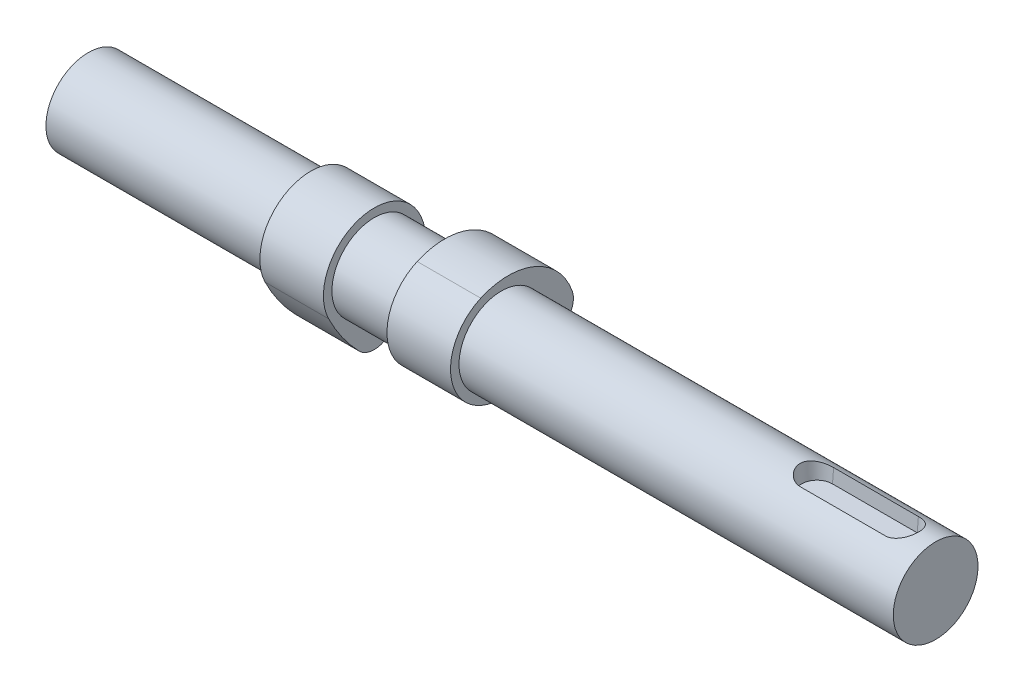
ISO-10303-21;
HEADER;
FILE_DESCRIPTION(('STEP AP214'),'2;1');
FILE_NAME('part.step','',(''),(''),'','','');
FILE_SCHEMA(('AUTOMOTIVE_DESIGN { 1 0 10303 214 1 1 1 1 }'));
ENDSEC;
DATA;
#1=APPLICATION_CONTEXT('core data for automotive mechanical design processes');
#2=APPLICATION_PROTOCOL_DEFINITION('international standard','automotive_design',2000,#1);
#3=PRODUCT_CONTEXT('',#1,'mechanical');
#4=PRODUCT('Part','Part','',(#3));
#5=PRODUCT_RELATED_PRODUCT_CATEGORY('part','',(#4));
#6=PRODUCT_DEFINITION_FORMATION('','',#4);
#7=PRODUCT_DEFINITION_CONTEXT('part definition',#1,'design');
#8=PRODUCT_DEFINITION('design','',#6,#7);
#9=PRODUCT_DEFINITION_SHAPE('','',#8);
#10=(LENGTH_UNIT() NAMED_UNIT(*) SI_UNIT(.MILLI.,.METRE.));
#11=(NAMED_UNIT(*) PLANE_ANGLE_UNIT() SI_UNIT($,.RADIAN.));
#12=(NAMED_UNIT(*) SI_UNIT($,.STERADIAN.) SOLID_ANGLE_UNIT());
#13=UNCERTAINTY_MEASURE_WITH_UNIT(LENGTH_MEASURE(1.E-05),#10,'distance_accuracy_value','');
#14=(GEOMETRIC_REPRESENTATION_CONTEXT(3) GLOBAL_UNCERTAINTY_ASSIGNED_CONTEXT((#13)) GLOBAL_UNIT_ASSIGNED_CONTEXT((#10,
#11,#12)) REPRESENTATION_CONTEXT('',''));
#15=CARTESIAN_POINT('',(0.,0.,0.));
#16=DIRECTION('',(0.,0.,1.));
#17=DIRECTION('',(1.,0.,0.));
#18=AXIS2_PLACEMENT_3D('',#15,#16,#17);
#19=CARTESIAN_POINT('',(-22.5,-1.62236318948022,3.65621904177247));
#20=DIRECTION('',(1.,0.,0.));
#21=DIRECTION('',(0.,1.,0.));
#22=AXIS2_PLACEMENT_3D('',#19,#20,#21);
#23=CYLINDRICAL_SURFACE('',#22,16.);
#24=CARTESIAN_POINT('',(-7.5,-1.62236318948022,3.65621904177247));
#25=DIRECTION('',(1.,0.,0.));
#26=DIRECTION('',(0.,1.,0.));
#27=AXIS2_PLACEMENT_3D('',#24,#25,#26);
#28=CIRCLE('',#27,16.);
#29=CARTESIAN_POINT('',(-7.5,-16.7126720366766,-1.66191774626015));
#30=VERTEX_POINT('',#29);
#31=CARTESIAN_POINT('',(-7.5,4.86708956844066,-10.9686571253174));
#32=VERTEX_POINT('',#31);
#33=EDGE_CURVE('E111',#30,#32,#28,.T.);
#34=ORIENTED_EDGE('',*,*,#33,.F.);
#35=DIRECTION('',(1.,0.,0.));
#36=VECTOR('',#35,1.);
#37=CARTESIAN_POINT('',(-22.5,-16.7126720366766,-1.66191774626015));
#38=LINE('',#37,#36);
#39=CARTESIAN_POINT('',(-22.5,-16.7126720366766,-1.66191774626015));
#40=VERTEX_POINT('',#39);
#41=EDGE_CURVE('E110',#40,#30,#38,.T.);
#42=ORIENTED_EDGE('',*,*,#41,.F.);
#43=CARTESIAN_POINT('',(-22.5,-1.62236318948022,3.65621904177247));
#44=DIRECTION('',(1.,0.,0.));
#45=DIRECTION('',(0.,1.,0.));
#46=AXIS2_PLACEMENT_3D('',#43,#44,#45);
#47=CIRCLE('',#46,16.);
#48=CARTESIAN_POINT('',(-22.5,4.86708956844066,-10.9686571253174));
#49=VERTEX_POINT('',#48);
#50=EDGE_CURVE('E105',#40,#49,#47,.T.);
#51=ORIENTED_EDGE('',*,*,#50,.T.);
#52=DIRECTION('',(1.,0.,0.));
#53=VECTOR('',#52,1.);
#54=CARTESIAN_POINT('',(-22.5,4.86708956844066,-10.9686571253174));
#55=LINE('',#54,#53);
#56=EDGE_CURVE('E12',#49,#32,#55,.T.);
#57=ORIENTED_EDGE('',*,*,#56,.T.);
#58=EDGE_LOOP('',(#34,#42,#51,#57));
#59=FACE_BOUND('',#58,.T.);
#60=ADVANCED_FACE('F48',(#59),#23,.T.);
#61=CARTESIAN_POINT('',(-22.5,0.,0.));
#62=DIRECTION('',(1.,0.,0.));
#63=DIRECTION('',(0.,1.,0.));
#64=AXIS2_PLACEMENT_3D('',#61,#62,#63);
#65=CYLINDRICAL_SURFACE('',#64,12.);
#66=CARTESIAN_POINT('',(-7.5,0.,0.));
#67=DIRECTION('',(1.,0.,0.));
#68=DIRECTION('',(0.,-1.,0.));
#69=AXIS2_PLACEMENT_3D('',#66,#67,#68);
#70=CIRCLE('',#69,12.);
#71=CARTESIAN_POINT('',(-7.5,-5.30622661682885,10.7630831591537));
#72=VERTEX_POINT('',#71);
#73=EDGE_CURVE('E113',#32,#72,#70,.T.);
#74=ORIENTED_EDGE('',*,*,#73,.F.);
#75=ORIENTED_EDGE('',*,*,#56,.F.);
#76=CARTESIAN_POINT('',(-22.5,0.,0.));
#77=DIRECTION('',(1.,0.,0.));
#78=DIRECTION('',(0.,-1.,0.));
#79=AXIS2_PLACEMENT_3D('',#76,#77,#78);
#80=CIRCLE('',#79,12.);
#81=CARTESIAN_POINT('',(-22.5,-5.30622661682885,10.7630831591537));
#82=VERTEX_POINT('',#81);
#83=EDGE_CURVE('E89',#49,#82,#80,.T.);
#84=ORIENTED_EDGE('',*,*,#83,.T.);
#85=DIRECTION('',(1.,0.,0.));
#86=VECTOR('',#85,1.);
#87=CARTESIAN_POINT('',(-22.5,-5.30622661682885,10.7630831591537));
#88=LINE('',#87,#86);
#89=EDGE_CURVE('E56',#82,#72,#88,.T.);
#90=ORIENTED_EDGE('',*,*,#89,.T.);
#91=EDGE_LOOP('',(#74,#75,#84,#90));
#92=FACE_BOUND('',#91,.T.);
#93=ADVANCED_FACE('F103',(#92),#65,.T.);
#94=CARTESIAN_POINT('',(-22.5,12.3811954392673,-25.1138607046919));
#95=DIRECTION('',(1.,0.,0.));
#96=DIRECTION('',(0.,1.,0.));
#97=AXIS2_PLACEMENT_3D('',#94,#95,#96);
#98=CYLINDRICAL_SURFACE('',#97,40.);
#99=CARTESIAN_POINT('',(-7.5,12.3811954392673,-25.1138607046919));
#100=DIRECTION('',(1.,0.,0.));
#101=DIRECTION('',(0.,-1.,0.));
#102=AXIS2_PLACEMENT_3D('',#99,#100,#101);
#103=CIRCLE('',#102,40.);
#104=CARTESIAN_POINT('',(-7.5,-15.4795428020985,3.58769438638459));
#105=VERTEX_POINT('',#104);
#106=EDGE_CURVE('E99',#72,#105,#103,.T.);
#107=ORIENTED_EDGE('',*,*,#106,.F.);
#108=ORIENTED_EDGE('',*,*,#89,.F.);
#109=CARTESIAN_POINT('',(-22.5,12.3811954392673,-25.1138607046919));
#110=DIRECTION('',(1.,0.,0.));
#111=DIRECTION('',(0.,-1.,0.));
#112=AXIS2_PLACEMENT_3D('',#109,#110,#111);
#113=CIRCLE('',#112,40.);
#114=CARTESIAN_POINT('',(-22.5,-15.4795428020985,3.58769438638459));
#115=VERTEX_POINT('',#114);
#116=EDGE_CURVE('E92',#82,#115,#113,.T.);
#117=ORIENTED_EDGE('',*,*,#116,.T.);
#118=DIRECTION('',(1.,0.,0.));
#119=VECTOR('',#118,1.);
#120=CARTESIAN_POINT('',(-22.5,-15.4795428020985,3.58769438638459));
#121=LINE('',#120,#119);
#122=EDGE_CURVE('E102',#115,#105,#121,.T.);
#123=ORIENTED_EDGE('',*,*,#122,.T.);
#124=EDGE_LOOP('',(#107,#108,#117,#123));
#125=FACE_BOUND('',#124,.T.);
#126=ADVANCED_FACE('F98',(#125),#98,.T.);
#127=CARTESIAN_POINT('',(-22.5,-11.9969505219277,0.));
#128=DIRECTION('',(1.,0.,0.));
#129=DIRECTION('',(0.,1.,0.));
#130=AXIS2_PLACEMENT_3D('',#127,#128,#129);
#131=CYLINDRICAL_SURFACE('',#130,5.);
#132=CARTESIAN_POINT('',(-7.5,-11.9969505219277,0.));
#133=DIRECTION('',(1.,0.,0.));
#134=DIRECTION('',(0.,1.,0.));
#135=AXIS2_PLACEMENT_3D('',#132,#133,#134);
#136=CIRCLE('',#135,5.);
#137=EDGE_CURVE('E78',#105,#30,#136,.T.);
#138=ORIENTED_EDGE('',*,*,#137,.F.);
#139=ORIENTED_EDGE('',*,*,#122,.F.);
#140=CARTESIAN_POINT('',(-22.5,-11.9969505219277,0.));
#141=DIRECTION('',(1.,0.,0.));
#142=DIRECTION('',(0.,1.,0.));
#143=AXIS2_PLACEMENT_3D('',#140,#141,#142);
#144=CIRCLE('',#143,5.);
#145=EDGE_CURVE('E64',#115,#40,#144,.T.);
#146=ORIENTED_EDGE('',*,*,#145,.T.);
#147=ORIENTED_EDGE('',*,*,#41,.T.);
#148=EDGE_LOOP('',(#138,#139,#146,#147));
#149=FACE_BOUND('',#148,.T.);
#150=ADVANCED_FACE('F122',(#149),#131,.T.);
#151=CARTESIAN_POINT('',(-22.5,-6.80965685570399,1.82810952088625));
#152=DIRECTION('',(1.,0.,0.));
#153=DIRECTION('',(0.,1.,0.));
#154=AXIS2_PLACEMENT_3D('',#151,#152,#153);
#155=PLANE('',#154);
#156=ORIENTED_EDGE('',*,*,#50,.F.);
#157=ORIENTED_EDGE('',*,*,#145,.F.);
#158=ORIENTED_EDGE('',*,*,#116,.F.);
#159=ORIENTED_EDGE('',*,*,#83,.F.);
#160=EDGE_LOOP('',(#156,#157,#158,#159));
#161=FACE_BOUND('',#160,.T.);
#162=ADVANCED_FACE('F94',(#161),#155,.F.);
#163=CARTESIAN_POINT('',(-7.5,-6.80965685570399,1.82810952088625));
#164=DIRECTION('',(1.,0.,0.));
#165=DIRECTION('',(0.,1.,0.));
#166=AXIS2_PLACEMENT_3D('',#163,#164,#165);
#167=PLANE('',#166);
#168=ORIENTED_EDGE('',*,*,#33,.T.);
#169=ORIENTED_EDGE('',*,*,#73,.T.);
#170=ORIENTED_EDGE('',*,*,#106,.T.);
#171=ORIENTED_EDGE('',*,*,#137,.T.);
#172=EDGE_LOOP('',(#168,#169,#170,#171));
#173=FACE_BOUND('',#172,.T.);
#174=ADVANCED_FACE('F118',(#173),#167,.T.);
#175=CLOSED_SHELL('',(#60,#93,#126,#150,#162,#174));
#176=MANIFOLD_SOLID_BREP('B2',#175);
#177=CARTESIAN_POINT('',(22.5,-3.65621904177246,-1.62236318948023));
#178=DIRECTION('',(-1.,0.,0.));
#179=DIRECTION('',(0.,0.,1.));
#180=AXIS2_PLACEMENT_3D('',#177,#178,#179);
#181=CYLINDRICAL_SURFACE('',#180,16.);
#182=CARTESIAN_POINT('',(7.5,-3.65621904177246,-1.62236318948023));
#183=DIRECTION('',(1.,0.,0.));
#184=DIRECTION('',(0.,0.,1.));
#185=AXIS2_PLACEMENT_3D('',#182,#183,#184);
#186=CIRCLE('',#185,16.);
#187=CARTESIAN_POINT('',(7.5,1.66191774626021,-16.7126720366766));
#188=VERTEX_POINT('',#187);
#189=CARTESIAN_POINT('',(7.5,10.9686571253174,4.8670895684407));
#190=VERTEX_POINT('',#189);
#191=EDGE_CURVE('E246',#188,#190,#186,.T.);
#192=ORIENTED_EDGE('',*,*,#191,.T.);
#193=DIRECTION('',(-1.,0.,0.));
#194=VECTOR('',#193,1.);
#195=CARTESIAN_POINT('',(22.5,10.9686571253174,4.8670895684407));
#196=LINE('',#195,#194);
#197=CARTESIAN_POINT('',(22.5,10.9686571253174,4.8670895684407));
#198=VERTEX_POINT('',#197);
#199=EDGE_CURVE('E46',#198,#190,#196,.T.);
#200=ORIENTED_EDGE('',*,*,#199,.F.);
#201=CARTESIAN_POINT('',(22.5,-3.65621904177246,-1.62236318948023));
#202=DIRECTION('',(1.,0.,0.));
#203=DIRECTION('',(0.,0.,1.));
#204=AXIS2_PLACEMENT_3D('',#201,#202,#203);
#205=CIRCLE('',#204,16.);
#206=CARTESIAN_POINT('',(22.5,1.66191774626021,-16.7126720366766));
#207=VERTEX_POINT('',#206);
#208=EDGE_CURVE('E234',#207,#198,#205,.T.);
#209=ORIENTED_EDGE('',*,*,#208,.F.);
#210=DIRECTION('',(-1.,0.,0.));
#211=VECTOR('',#210,1.);
#212=CARTESIAN_POINT('',(22.5,1.66191774626021,-16.7126720366766));
#213=LINE('',#212,#211);
#214=EDGE_CURVE('E242',#207,#188,#213,.T.);
#215=ORIENTED_EDGE('',*,*,#214,.T.);
#216=EDGE_LOOP('',(#192,#200,#209,#215));
#217=FACE_BOUND('',#216,.T.);
#218=ADVANCED_FACE('F183',(#217),#181,.T.);
#219=CARTESIAN_POINT('',(22.5,0.,0.));
#220=DIRECTION('',(-1.,0.,0.));
#221=DIRECTION('',(0.,0.,1.));
#222=AXIS2_PLACEMENT_3D('',#219,#220,#221);
#223=CYLINDRICAL_SURFACE('',#222,12.);
#224=CARTESIAN_POINT('',(7.5,0.,0.));
#225=DIRECTION('',(1.,0.,0.));
#226=DIRECTION('',(0.,0.,-1.));
#227=AXIS2_PLACEMENT_3D('',#224,#225,#226);
#228=CIRCLE('',#227,12.);
#229=CARTESIAN_POINT('',(7.5,-10.7630831591536,-5.30622661682888));
#230=VERTEX_POINT('',#229);
#231=EDGE_CURVE('E238',#190,#230,#228,.T.);
#232=ORIENTED_EDGE('',*,*,#231,.T.);
#233=DIRECTION('',(-1.,0.,0.));
#234=VECTOR('',#233,1.);
#235=CARTESIAN_POINT('',(22.5,-10.7630831591536,-5.30622661682888));
#236=LINE('',#235,#234);
#237=CARTESIAN_POINT('',(22.5,-10.7630831591536,-5.30622661682888));
#238=VERTEX_POINT('',#237);
#239=EDGE_CURVE('E191',#238,#230,#236,.T.);
#240=ORIENTED_EDGE('',*,*,#239,.F.);
#241=CARTESIAN_POINT('',(22.5,0.,0.));
#242=DIRECTION('',(1.,0.,0.));
#243=DIRECTION('',(0.,0.,-1.));
#244=AXIS2_PLACEMENT_3D('',#241,#242,#243);
#245=CIRCLE('',#244,12.);
#246=EDGE_CURVE('E229',#198,#238,#245,.T.);
#247=ORIENTED_EDGE('',*,*,#246,.F.);
#248=ORIENTED_EDGE('',*,*,#199,.T.);
#249=EDGE_LOOP('',(#232,#240,#247,#248));
#250=FACE_BOUND('',#249,.T.);
#251=ADVANCED_FACE('F237',(#250),#223,.T.);
#252=CARTESIAN_POINT('',(22.5,25.1138607046918,12.3811954392674));
#253=DIRECTION('',(-1.,0.,0.));
#254=DIRECTION('',(0.,0.,1.));
#255=AXIS2_PLACEMENT_3D('',#252,#253,#254);
#256=CYLINDRICAL_SURFACE('',#255,40.);
#257=CARTESIAN_POINT('',(7.5,25.1138607046918,12.3811954392674));
#258=DIRECTION('',(1.,0.,0.));
#259=DIRECTION('',(0.,0.,-1.));
#260=AXIS2_PLACEMENT_3D('',#257,#258,#259);
#261=CIRCLE('',#260,40.);
#262=CARTESIAN_POINT('',(7.5,-3.58769438638454,-15.4795428020985));
#263=VERTEX_POINT('',#262);
#264=EDGE_CURVE('E216',#230,#263,#261,.T.);
#265=ORIENTED_EDGE('',*,*,#264,.T.);
#266=DIRECTION('',(-1.,0.,0.));
#267=VECTOR('',#266,1.);
#268=CARTESIAN_POINT('',(22.5,-3.58769438638454,-15.4795428020985));
#269=LINE('',#268,#267);
#270=CARTESIAN_POINT('',(22.5,-3.58769438638454,-15.4795428020985));
#271=VERTEX_POINT('',#270);
#272=EDGE_CURVE('E239',#271,#263,#269,.T.);
#273=ORIENTED_EDGE('',*,*,#272,.F.);
#274=CARTESIAN_POINT('',(22.5,25.1138607046918,12.3811954392674));
#275=DIRECTION('',(1.,0.,0.));
#276=DIRECTION('',(0.,0.,-1.));
#277=AXIS2_PLACEMENT_3D('',#274,#275,#276);
#278=CIRCLE('',#277,40.);
#279=EDGE_CURVE('E232',#238,#271,#278,.T.);
#280=ORIENTED_EDGE('',*,*,#279,.F.);
#281=ORIENTED_EDGE('',*,*,#239,.T.);
#282=EDGE_LOOP('',(#265,#273,#280,#281));
#283=FACE_BOUND('',#282,.T.);
#284=ADVANCED_FACE('F240',(#283),#256,.T.);
#285=CARTESIAN_POINT('',(22.5,0.,-11.9969505219277));
#286=DIRECTION('',(-1.,0.,0.));
#287=DIRECTION('',(0.,0.,1.));
#288=AXIS2_PLACEMENT_3D('',#285,#286,#287);
#289=CYLINDRICAL_SURFACE('',#288,5.);
#290=CARTESIAN_POINT('',(7.5,0.,-11.9969505219277));
#291=DIRECTION('',(1.,0.,0.));
#292=DIRECTION('',(0.,0.,1.));
#293=AXIS2_PLACEMENT_3D('',#290,#291,#292);
#294=CIRCLE('',#293,5.);
#295=EDGE_CURVE('E222',#263,#188,#294,.T.);
#296=ORIENTED_EDGE('',*,*,#295,.T.);
#297=ORIENTED_EDGE('',*,*,#214,.F.);
#298=CARTESIAN_POINT('',(22.5,0.,-11.9969505219277));
#299=DIRECTION('',(1.,0.,0.));
#300=DIRECTION('',(0.,0.,1.));
#301=AXIS2_PLACEMENT_3D('',#298,#299,#300);
#302=CIRCLE('',#301,5.);
#303=EDGE_CURVE('E199',#271,#207,#302,.T.);
#304=ORIENTED_EDGE('',*,*,#303,.F.);
#305=ORIENTED_EDGE('',*,*,#272,.T.);
#306=EDGE_LOOP('',(#296,#297,#304,#305));
#307=FACE_BOUND('',#306,.T.);
#308=ADVANCED_FACE('F253',(#307),#289,.T.);
#309=CARTESIAN_POINT('',(22.5,-1.82810952088623,-6.80965685570399));
#310=DIRECTION('',(-1.,0.,0.));
#311=DIRECTION('',(0.,0.,1.));
#312=AXIS2_PLACEMENT_3D('',#309,#310,#311);
#313=PLANE('',#312);
#314=ORIENTED_EDGE('',*,*,#208,.T.);
#315=ORIENTED_EDGE('',*,*,#246,.T.);
#316=ORIENTED_EDGE('',*,*,#279,.T.);
#317=ORIENTED_EDGE('',*,*,#303,.T.);
#318=EDGE_LOOP('',(#314,#315,#316,#317));
#319=FACE_BOUND('',#318,.T.);
#320=ADVANCED_FACE('F230',(#319),#313,.F.);
#321=CARTESIAN_POINT('',(7.5,-1.82810952088623,-6.80965685570399));
#322=DIRECTION('',(-1.,0.,0.));
#323=DIRECTION('',(0.,0.,1.));
#324=AXIS2_PLACEMENT_3D('',#321,#322,#323);
#325=PLANE('',#324);
#326=ORIENTED_EDGE('',*,*,#191,.F.);
#327=ORIENTED_EDGE('',*,*,#295,.F.);
#328=ORIENTED_EDGE('',*,*,#264,.F.);
#329=ORIENTED_EDGE('',*,*,#231,.F.);
#330=EDGE_LOOP('',(#326,#327,#328,#329));
#331=FACE_BOUND('',#330,.T.);
#332=ADVANCED_FACE('F256',(#331),#325,.T.);
#333=CLOSED_SHELL('',(#218,#251,#284,#308,#320,#332));
#334=MANIFOLD_SOLID_BREP('B6',#333);
#335=CARTESIAN_POINT('',(-75.,0.,0.));
#336=DIRECTION('',(1.,0.,0.));
#337=DIRECTION('',(0.,0.,-1.));
#338=AXIS2_PLACEMENT_3D('',#335,#336,#337);
#339=CYLINDRICAL_SURFACE('',#338,10.);
#340=CARTESIAN_POINT('',(116.9998,9.19554732162667,3.92961950520971));
#341=CARTESIAN_POINT('',(117.108432526229,9.195523964617,3.92963900895938));
#342=CARTESIAN_POINT('',(117.217054442407,9.19739790113637,3.92528821148888));
#343=CARTESIAN_POINT('',(117.433449189068,9.20478322107422,3.90795696349252));
#344=CARTESIAN_POINT('',(117.541222281507,9.21029343390919,3.89497929010511));
#345=CARTESIAN_POINT('',(117.754805249896,9.22477014169951,3.86056266999496));
#346=CARTESIAN_POINT('',(117.860620479704,9.23372503404509,3.83915212174359));
#347=CARTESIAN_POINT('',(118.069896437043,9.25479066145063,3.78808770588497));
#348=CARTESIAN_POINT('',(118.173357048389,9.26690155187349,3.75843343245227));
#349=CARTESIAN_POINT('',(118.478997114603,9.30741193624863,3.65751207972482));
#350=CARTESIAN_POINT('',(118.676801412905,9.34001597020544,3.57422665843843));
#351=CARTESIAN_POINT('',(119.055656727802,9.41272444967854,3.37809141880251));
#352=CARTESIAN_POINT('',(119.236694043575,9.45283494952219,3.26521770641159));
#353=CARTESIAN_POINT('',(119.586163210606,9.53832850590639,3.00660395270599));
#354=CARTESIAN_POINT('',(119.75359745749,9.58387103250205,2.85956460575029));
#355=CARTESIAN_POINT('',(120.06167183687,9.67365894564606,2.53928149200147));
#356=CARTESIAN_POINT('',(120.202307528385,9.7179041161741,2.36603339048636));
#357=CARTESIAN_POINT('',(120.455271105667,9.80118313396661,1.99346714637655));
#358=CARTESIAN_POINT('',(120.566978377658,9.84009542627471,1.79369791629397));
#359=CARTESIAN_POINT('',(120.754126120008,9.90710575454472,1.37616732968246));
#360=CARTESIAN_POINT('',(120.829586514252,9.93520972983524,1.15841593476275));
#361=CARTESIAN_POINT('',(120.937423647946,9.97586398416612,0.725552222129558));
#362=CARTESIAN_POINT('',(120.972183980034,9.98927144663287,0.511115107829932));
#363=CARTESIAN_POINT('',(121.005253036647,10.0020189726074,0.0790606490660696));
#364=CARTESIAN_POINT('',(121.003575139474,10.0013641990691,-0.138555498890744));
#365=CARTESIAN_POINT('',(120.965065772481,9.98653634618633,-0.55713437731378));
#366=CARTESIAN_POINT('',(120.930314495065,9.97316323800987,-0.758322063329801));
#367=CARTESIAN_POINT('',(120.830073130865,9.93541593559446,-1.15177617887117));
#368=CARTESIAN_POINT('',(120.764581003034,9.91104101089147,-1.34404201509667));
#369=CARTESIAN_POINT('',(120.603676754373,9.8530923067776,-1.71848117040827));
#370=CARTESIAN_POINT('',(120.50772071095,9.81935282430629,-1.90039390354836));
#371=CARTESIAN_POINT('',(120.289247885583,9.74606742103519,-2.24621081177601));
#372=CARTESIAN_POINT('',(120.166721786218,9.70651946492988,-2.41010863904958));
#373=CARTESIAN_POINT('',(119.888474496445,9.62225347352947,-2.72785507367911));
#374=CARTESIAN_POINT('',(119.730991599461,9.57736844831364,-2.88011561690002));
#375=CARTESIAN_POINT('',(119.39269852426,9.48965886456742,-3.15714116902367));
#376=CARTESIAN_POINT('',(119.211877236817,9.44683530072072,-3.28189300651247));
#377=CARTESIAN_POINT('',(118.922606169477,9.38686542506334,-3.44824964477365));
#378=CARTESIAN_POINT('',(118.820957447824,9.36724202522513,-3.50106618947219));
#379=CARTESIAN_POINT('',(118.613181248028,9.33044058072898,-3.5979946757925));
#380=CARTESIAN_POINT('',(118.507055578203,9.31326156077457,-3.64211009185354));
#381=CARTESIAN_POINT('',(118.291154422689,9.28193522243321,-3.72122180241614));
#382=CARTESIAN_POINT('',(118.181382861742,9.26778475870701,-3.75622756608453));
#383=CARTESIAN_POINT('',(117.958933082548,9.24298582877054,-3.81684131432378));
#384=CARTESIAN_POINT('',(117.846256085105,9.23233591674958,-3.84245317930481));
#385=CARTESIAN_POINT('',(117.611930809076,9.21440060696265,-3.88528372873352));
#386=CARTESIAN_POINT('',(117.490152858103,9.20735840438907,-3.90189924806992));
#387=CARTESIAN_POINT('',(117.245519514609,9.19791466072453,-3.92407823700824));
#388=CARTESIAN_POINT('',(117.122665085282,9.19550932696913,-3.92965073920191));
#389=CARTESIAN_POINT('',(116.9998,9.19554732162666,-3.92961950520972));
#390=B_SPLINE_CURVE_WITH_KNOTS('',3,(#340,#341,#342,#343,#344,#345,#346,#347,#348,#349,#350,
#351,#352,#353,#354,#355,#356,#357,#358,#359,#360,#361,#362,#363,#364,#365,#366,#367,#368,#369,
#370,#371,#372,#373,#374,#375,#376,#377,#378,#379,#380,#381,#382,#383,#384,#385,#386,#387,#388,
#389),.UNSPECIFIED.,.F.,.F.,(4,2,2,2,2,2,2,2,2,2,2,2,2,2,2,2,2,2,2,2,2,2,2,2,4),(0.,
0.325775853756532,0.651446885464914,0.976030440919044,1.3006299779342,1.94872565760357,
2.59734632832016,3.27656669617222,3.9558995248008,4.64878303442882,5.34128524851461,
5.99080148182277,6.64007924914105,7.25104428619564,7.86204989415494,8.48464423808043,
9.10745726360786,9.77538752835235,10.4436369129641,10.7919327546046,11.1400892357431,
11.4878823615824,11.8355316596004,12.2042630896941,12.5726927926964),.UNSPECIFIED.);
#391=CARTESIAN_POINT('',(117.,9.19554731953007,3.92961951011584));
#392=VERTEX_POINT('',#391);
#393=CARTESIAN_POINT('',(117.,9.19554731953009,-3.92961951011584));
#394=VERTEX_POINT('',#393);
#395=EDGE_CURVE('E384',#392,#394,#390,.T.);
#396=ORIENTED_EDGE('',*,*,#395,.F.);
#397=DIRECTION('',(1.,0.,0.));
#398=VECTOR('',#397,1.);
#399=CARTESIAN_POINT('',(-75.,9.19554731953007,3.92961951011589));
#400=LINE('',#399,#398);
#401=CARTESIAN_POINT('',(97.,9.19554731953009,3.92961951011584));
#402=VERTEX_POINT('',#401);
#403=EDGE_CURVE('E181',#402,#392,#400,.T.);
#404=ORIENTED_EDGE('',*,*,#403,.F.);
#405=CARTESIAN_POINT('',(97.0002,9.19554732162667,-3.92961950520971));
#406=CARTESIAN_POINT('',(96.8915674737709,9.19552396461699,-3.92963900895938));
#407=CARTESIAN_POINT('',(96.7829455575925,9.19739790113637,-3.92528821148888));
#408=CARTESIAN_POINT('',(96.5665508109321,9.20478322107422,-3.90795696349252));
#409=CARTESIAN_POINT('',(96.4587777184928,9.21029343390919,-3.89497929010511));
#410=CARTESIAN_POINT('',(96.2451947501037,9.22477014169951,-3.86056266999496));
#411=CARTESIAN_POINT('',(96.1393795202961,9.23372503404509,-3.83915212174359));
#412=CARTESIAN_POINT('',(95.9301035629571,9.25479066145063,-3.78808770588497));
#413=CARTESIAN_POINT('',(95.8266429516112,9.26690155187349,-3.75843343245227));
#414=CARTESIAN_POINT('',(95.5210028853967,9.30741193624863,-3.65751207972481));
#415=CARTESIAN_POINT('',(95.3231985870946,9.34001597020544,-3.57422665843843));
#416=CARTESIAN_POINT('',(94.9443432721979,9.41272444967854,-3.3780914188025));
#417=CARTESIAN_POINT('',(94.7633059564248,9.45283494952219,-3.26521770641159));
#418=CARTESIAN_POINT('',(94.413836789394,9.53832850590639,-3.00660395270599));
#419=CARTESIAN_POINT('',(94.2464025425101,9.58387103250205,-2.85956460575029));
#420=CARTESIAN_POINT('',(93.9383281631304,9.67365894564606,-2.53928149200146));
#421=CARTESIAN_POINT('',(93.7976924716152,9.7179041161741,-2.36603339048636));
#422=CARTESIAN_POINT('',(93.544728894333,9.80118313396661,-1.99346714637655));
#423=CARTESIAN_POINT('',(93.4330216223424,9.84009542627471,-1.79369791629397));
#424=CARTESIAN_POINT('',(93.2458738799919,9.90710575454472,-1.37616732968245));
#425=CARTESIAN_POINT('',(93.1704134857481,9.93520972983524,-1.15841593476274));
#426=CARTESIAN_POINT('',(93.0625763520545,9.97586398416612,-0.725552222129557));
#427=CARTESIAN_POINT('',(93.0278160199655,9.98927144663287,-0.511115107829932));
#428=CARTESIAN_POINT('',(92.9947469633532,10.0020189726074,-0.0790606490660688));
#429=CARTESIAN_POINT('',(92.9964248605263,10.0013641990691,0.138555498890745));
#430=CARTESIAN_POINT('',(93.0349342275193,9.98653634618633,0.557134377313781));
#431=CARTESIAN_POINT('',(93.0696855049347,9.97316323800987,0.758322063329801));
#432=CARTESIAN_POINT('',(93.1699268691349,9.93541593559446,1.15177617887117));
#433=CARTESIAN_POINT('',(93.2354189969656,9.91104101089147,1.34404201509667));
#434=CARTESIAN_POINT('',(93.3963232456273,9.8530923067776,1.71848117040827));
#435=CARTESIAN_POINT('',(93.4922792890503,9.81935282430629,1.90039390354836));
#436=CARTESIAN_POINT('',(93.7107521144166,9.74606742103519,2.24621081177601));
#437=CARTESIAN_POINT('',(93.8332782137822,9.70651946492988,2.41010863904958));
#438=CARTESIAN_POINT('',(94.1115255035547,9.62225347352947,2.7278550736791));
#439=CARTESIAN_POINT('',(94.2690084005388,9.57736844831365,2.88011561690001));
#440=CARTESIAN_POINT('',(94.6073014757403,9.48965886456742,3.15714116902367));
#441=CARTESIAN_POINT('',(94.7881227631832,9.44683530072072,3.28189300651247));
#442=CARTESIAN_POINT('',(95.0773938305227,9.38686542506334,3.44824964477365));
#443=CARTESIAN_POINT('',(95.1790425521757,9.36724202522513,3.5010661894722));
#444=CARTESIAN_POINT('',(95.386818751972,9.33044058072897,3.5979946757925));
#445=CARTESIAN_POINT('',(95.4929444217969,9.31326156077457,3.64211009185354));
#446=CARTESIAN_POINT('',(95.7088455773114,9.28193522243321,3.72122180241614));
#447=CARTESIAN_POINT('',(95.8186171382581,9.26778475870701,3.75622756608453));
#448=CARTESIAN_POINT('',(96.0410669174523,9.24298582877054,3.81684131432378));
#449=CARTESIAN_POINT('',(96.1537439148955,9.23233591674958,3.84245317930481));
#450=CARTESIAN_POINT('',(96.388069190924,9.21440060696266,3.88528372873352));
#451=CARTESIAN_POINT('',(96.5098471418972,9.20735840438907,3.90189924806992));
#452=CARTESIAN_POINT('',(96.7544804853914,9.19791466072453,3.92407823700824));
#453=CARTESIAN_POINT('',(96.8773349147178,9.19550932696913,3.92965073920191));
#454=CARTESIAN_POINT('',(97.0002,9.19554732162666,3.92961950520972));
#455=B_SPLINE_CURVE_WITH_KNOTS('',3,(#405,#406,#407,#408,#409,#410,#411,#412,#413,#414,#415,
#416,#417,#418,#419,#420,#421,#422,#423,#424,#425,#426,#427,#428,#429,#430,#431,#432,#433,#434,
#435,#436,#437,#438,#439,#440,#441,#442,#443,#444,#445,#446,#447,#448,#449,#450,#451,#452,#453,
#454),.UNSPECIFIED.,.F.,.F.,(4,2,2,2,2,2,2,2,2,2,2,2,2,2,2,2,2,2,2,2,2,2,2,2,4),(0.,
0.325775853756532,0.6514468854649,0.97603044091903,1.3006299779342,1.94872565760357,
2.59734632832017,3.27656669617222,3.9558995248008,4.64878303442882,5.34128524851461,
5.99080148182277,6.64007924914105,7.25104428619564,7.86204989415493,8.48464423808043,
9.10745726360786,9.77538752835234,10.4436369129641,10.7919327546046,11.1400892357431,
11.4878823615824,11.8355316596004,12.204263089694,12.5726927926964),.UNSPECIFIED.);
#456=CARTESIAN_POINT('',(97.,9.1955473195301,-3.92961951011584));
#457=VERTEX_POINT('',#456);
#458=EDGE_CURVE('E317',#457,#402,#455,.T.);
#459=ORIENTED_EDGE('',*,*,#458,.F.);
#460=DIRECTION('',(1.,0.,0.));
#461=VECTOR('',#460,1.);
#462=CARTESIAN_POINT('',(-75.,9.19554731953011,-3.92961951011579));
#463=LINE('',#462,#461);
#464=EDGE_CURVE('E356',#394,#457,#463,.F.);
#465=ORIENTED_EDGE('',*,*,#464,.F.);
#466=EDGE_LOOP('',(#396,#404,#459,#465));
#467=FACE_BOUND('',#466,.T.);
#468=CARTESIAN_POINT('',(-75.,0.,0.));
#469=DIRECTION('',(1.,0.,0.));
#470=DIRECTION('',(0.,0.,-1.));
#471=AXIS2_PLACEMENT_3D('',#468,#469,#470);
#472=CIRCLE('',#471,10.);
#473=CARTESIAN_POINT('',(-75.,0.,-10.));
#474=VERTEX_POINT('',#473);
#475=EDGE_CURVE('E381',#474,#474,#472,.T.);
#476=ORIENTED_EDGE('',*,*,#475,.T.);
#477=EDGE_LOOP('',(#476));
#478=FACE_BOUND('',#477,.T.);
#479=CARTESIAN_POINT('',(125.,0.,0.));
#480=DIRECTION('',(1.,0.,0.));
#481=DIRECTION('',(0.,0.,-1.));
#482=AXIS2_PLACEMENT_3D('',#479,#480,#481);
#483=CIRCLE('',#482,10.);
#484=CARTESIAN_POINT('',(125.,0.,-10.));
#485=VERTEX_POINT('',#484);
#486=EDGE_CURVE('E358',#485,#485,#483,.T.);
#487=ORIENTED_EDGE('',*,*,#486,.F.);
#488=EDGE_LOOP('',(#487));
#489=FACE_BOUND('',#488,.T.);
#490=ADVANCED_FACE('F309',(#467,#478,#489),#339,.T.);
#491=CARTESIAN_POINT('',(-75.,0.,0.));
#492=DIRECTION('',(1.,0.,0.));
#493=DIRECTION('',(0.,0.,-1.));
#494=AXIS2_PLACEMENT_3D('',#491,#492,#493);
#495=PLANE('',#494);
#496=ORIENTED_EDGE('',*,*,#475,.F.);
#497=EDGE_LOOP('',(#496));
#498=FACE_BOUND('',#497,.T.);
#499=ADVANCED_FACE('F403',(#498),#495,.F.);
#500=CARTESIAN_POINT('',(125.,0.,0.));
#501=DIRECTION('',(1.,0.,0.));
#502=DIRECTION('',(0.,0.,-1.));
#503=AXIS2_PLACEMENT_3D('',#500,#501,#502);
#504=PLANE('',#503);
#505=ORIENTED_EDGE('',*,*,#486,.T.);
#506=EDGE_LOOP('',(#505));
#507=FACE_BOUND('',#506,.T.);
#508=ADVANCED_FACE('F401',(#507),#504,.T.);
#509=CARTESIAN_POINT('',(97.,10.,0.));
#510=DIRECTION('',(0.,1.,0.));
#511=DIRECTION('',(0.,0.,1.));
#512=AXIS2_PLACEMENT_3D('',#509,#510,#511);
#513=CONICAL_SURFACE('',#512,4.,0.0872664625997167);
#514=DIRECTION('',(0.,0.996194698091745,-0.0871557427476584));
#515=VECTOR('',#514,1.);
#516=CARTESIAN_POINT('',(97.,10.,-4.));
#517=LINE('',#516,#515);
#518=CARTESIAN_POINT('',(97.,6.,-3.6500453458963));
#519=VERTEX_POINT('',#518);
#520=EDGE_CURVE('E350',#519,#457,#517,.T.);
#521=ORIENTED_EDGE('',*,*,#520,.T.);
#522=ORIENTED_EDGE('',*,*,#458,.T.);
#523=DIRECTION('',(0.,0.996194698091745,0.0871557427476584));
#524=VECTOR('',#523,1.);
#525=CARTESIAN_POINT('',(97.,10.,4.));
#526=LINE('',#525,#524);
#527=CARTESIAN_POINT('',(97.,6.,3.65004534589631));
#528=VERTEX_POINT('',#527);
#529=EDGE_CURVE('E323',#528,#402,#526,.T.);
#530=ORIENTED_EDGE('',*,*,#529,.F.);
#531=CARTESIAN_POINT('',(97.,6.,0.));
#532=DIRECTION('',(0.,1.,0.));
#533=DIRECTION('',(0.,0.,1.));
#534=AXIS2_PLACEMENT_3D('',#531,#532,#533);
#535=CIRCLE('',#534,3.6500453458963);
#536=EDGE_CURVE('E362',#519,#528,#535,.T.);
#537=ORIENTED_EDGE('',*,*,#536,.F.);
#538=EDGE_LOOP('',(#521,#522,#530,#537));
#539=FACE_BOUND('',#538,.T.);
#540=ADVANCED_FACE('F363',(#539),#513,.F.);
#541=CARTESIAN_POINT('',(97.,10.,-4.));
#542=DIRECTION('',(0.,-0.0871557427476584,-0.996194698091746));
#543=DIRECTION('',(0.,0.996194698091746,-0.0871557427476584));
#544=AXIS2_PLACEMENT_3D('',#541,#542,#543);
#545=PLANE('',#544);
#546=ORIENTED_EDGE('',*,*,#464,.T.);
#547=ORIENTED_EDGE('',*,*,#520,.F.);
#548=DIRECTION('',(-1.,0.,0.));
#549=VECTOR('',#548,1.);
#550=CARTESIAN_POINT('',(97.,6.,-3.6500453458963));
#551=LINE('',#550,#549);
#552=CARTESIAN_POINT('',(117.,6.,-3.6500453458963));
#553=VERTEX_POINT('',#552);
#554=EDGE_CURVE('E355',#553,#519,#551,.T.);
#555=ORIENTED_EDGE('',*,*,#554,.F.);
#556=DIRECTION('',(0.,0.996194698091745,-0.0871557427476584));
#557=VECTOR('',#556,1.);
#558=CARTESIAN_POINT('',(117.,10.,-4.));
#559=LINE('',#558,#557);
#560=EDGE_CURVE('E359',#553,#394,#559,.T.);
#561=ORIENTED_EDGE('',*,*,#560,.T.);
#562=EDGE_LOOP('',(#546,#547,#555,#561));
#563=FACE_BOUND('',#562,.T.);
#564=ADVANCED_FACE('F352',(#563),#545,.F.);
#565=CARTESIAN_POINT('',(117.,10.,0.));
#566=DIRECTION('',(0.,1.,0.));
#567=DIRECTION('',(0.,0.,1.));
#568=AXIS2_PLACEMENT_3D('',#565,#566,#567);
#569=CONICAL_SURFACE('',#568,4.,0.0872664625997167);
#570=DIRECTION('',(0.,0.996194698091745,0.0871557427476584));
#571=VECTOR('',#570,1.);
#572=CARTESIAN_POINT('',(117.,10.,4.));
#573=LINE('',#572,#571);
#574=CARTESIAN_POINT('',(117.,6.,3.6500453458963));
#575=VERTEX_POINT('',#574);
#576=EDGE_CURVE('E373',#575,#392,#573,.T.);
#577=ORIENTED_EDGE('',*,*,#576,.T.);
#578=ORIENTED_EDGE('',*,*,#395,.T.);
#579=ORIENTED_EDGE('',*,*,#560,.F.);
#580=CARTESIAN_POINT('',(117.,6.,0.));
#581=DIRECTION('',(0.,1.,0.));
#582=DIRECTION('',(0.,0.,1.));
#583=AXIS2_PLACEMENT_3D('',#580,#581,#582);
#584=CIRCLE('',#583,3.6500453458963);
#585=EDGE_CURVE('E371',#575,#553,#584,.T.);
#586=ORIENTED_EDGE('',*,*,#585,.F.);
#587=EDGE_LOOP('',(#577,#578,#579,#586));
#588=FACE_BOUND('',#587,.T.);
#589=ADVANCED_FACE('F391',(#588),#569,.F.);
#590=CARTESIAN_POINT('',(97.,10.,4.));
#591=DIRECTION('',(0.,-0.0871557427476584,0.996194698091746));
#592=DIRECTION('',(0.,-0.996194698091746,-0.0871557427476584));
#593=AXIS2_PLACEMENT_3D('',#590,#591,#592);
#594=PLANE('',#593);
#595=ORIENTED_EDGE('',*,*,#403,.T.);
#596=ORIENTED_EDGE('',*,*,#576,.F.);
#597=DIRECTION('',(1.,0.,0.));
#598=VECTOR('',#597,1.);
#599=CARTESIAN_POINT('',(97.,6.,3.65004534589631));
#600=LINE('',#599,#598);
#601=EDGE_CURVE('E366',#528,#575,#600,.T.);
#602=ORIENTED_EDGE('',*,*,#601,.F.);
#603=ORIENTED_EDGE('',*,*,#529,.T.);
#604=EDGE_LOOP('',(#595,#596,#602,#603));
#605=FACE_BOUND('',#604,.T.);
#606=ADVANCED_FACE('F396',(#605),#594,.F.);
#607=CARTESIAN_POINT('',(97.,6.,0.));
#608=DIRECTION('',(0.,1.,0.));
#609=DIRECTION('',(0.,0.,1.));
#610=AXIS2_PLACEMENT_3D('',#607,#608,#609);
#611=PLANE('',#610);
#612=ORIENTED_EDGE('',*,*,#536,.T.);
#613=ORIENTED_EDGE('',*,*,#601,.T.);
#614=ORIENTED_EDGE('',*,*,#585,.T.);
#615=ORIENTED_EDGE('',*,*,#554,.T.);
#616=EDGE_LOOP('',(#612,#613,#614,#615));
#617=FACE_BOUND('',#616,.T.);
#618=ADVANCED_FACE('F369',(#617),#611,.T.);
#619=CLOSED_SHELL('',(#490,#499,#508,#540,#564,#589,#606,#618));
#620=MANIFOLD_SOLID_BREP('B40',#619);
#621=ADVANCED_BREP_SHAPE_REPRESENTATION('',(#18,#176,#334,#620),#14);
#622=SHAPE_DEFINITION_REPRESENTATION(#9,#621);
ENDSEC;
END-ISO-10303-21;
